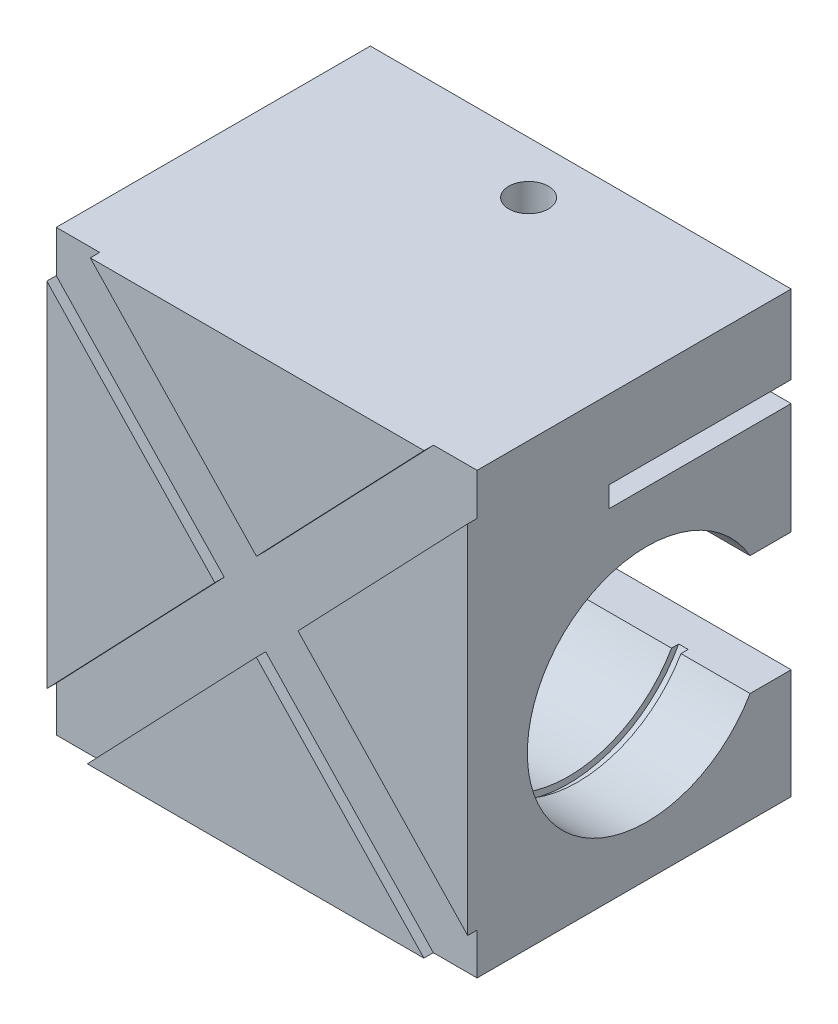
ISO-10303-21;
HEADER;
FILE_DESCRIPTION(('STEP AP214'),'2;1');
FILE_NAME('part.step','',(''),(''),'','','');
FILE_SCHEMA(('AUTOMOTIVE_DESIGN { 1 0 10303 214 1 1 1 1 }'));
ENDSEC;
DATA;
#1=APPLICATION_CONTEXT('core data for automotive mechanical design processes');
#2=APPLICATION_PROTOCOL_DEFINITION('international standard','automotive_design',2000,#1);
#3=PRODUCT_CONTEXT('',#1,'mechanical');
#4=PRODUCT('Part','Part','',(#3));
#5=PRODUCT_RELATED_PRODUCT_CATEGORY('part','',(#4));
#6=PRODUCT_DEFINITION_FORMATION('','',#4);
#7=PRODUCT_DEFINITION_CONTEXT('part definition',#1,'design');
#8=PRODUCT_DEFINITION('design','',#6,#7);
#9=PRODUCT_DEFINITION_SHAPE('','',#8);
#10=(LENGTH_UNIT() NAMED_UNIT(*) SI_UNIT(.MILLI.,.METRE.));
#11=(NAMED_UNIT(*) PLANE_ANGLE_UNIT() SI_UNIT($,.RADIAN.));
#12=(NAMED_UNIT(*) SI_UNIT($,.STERADIAN.) SOLID_ANGLE_UNIT());
#13=UNCERTAINTY_MEASURE_WITH_UNIT(LENGTH_MEASURE(1.E-05),#10,'distance_accuracy_value','');
#14=(GEOMETRIC_REPRESENTATION_CONTEXT(3) GLOBAL_UNCERTAINTY_ASSIGNED_CONTEXT((#13)) GLOBAL_UNIT_ASSIGNED_CONTEXT((#10,
#11,#12)) REPRESENTATION_CONTEXT('',''));
#15=CARTESIAN_POINT('',(0.,0.,0.));
#16=DIRECTION('',(0.,0.,1.));
#17=DIRECTION('',(1.,0.,0.));
#18=AXIS2_PLACEMENT_3D('',#15,#16,#17);
#19=CARTESIAN_POINT('',(-67.,0.,50.));
#20=DIRECTION('',(0.,0.,1.));
#21=DIRECTION('',(1.,0.,0.));
#22=AXIS2_PLACEMENT_3D('',#19,#20,#21);
#23=PLANE('',#22);
#24=DIRECTION('',(-0.687892349406312,0.725812727656566,0.));
#25=VECTOR('',#24,1.);
#26=CARTESIAN_POINT('',(3.29703367803096,3.12477882576566,50.));
#27=LINE('',#26,#25);
#28=CARTESIAN_POINT('',(0.,6.60356298304335,50.));
#29=VERTEX_POINT('',#28);
#30=CARTESIAN_POINT('',(-27.009894200004,35.1023898706218,50.));
#31=VERTEX_POINT('',#30);
#32=EDGE_CURVE('E126',#29,#31,#27,.T.);
#33=ORIENTED_EDGE('',*,*,#32,.T.);
#34=DIRECTION('',(-0.690869316587817,-0.722979659048222,0.));
#35=VECTOR('',#34,1.);
#36=CARTESIAN_POINT('',(-31.651158906905,30.2454076675031,50.));
#37=LINE('',#36,#35);
#38=CARTESIAN_POINT('',(0.,63.367654560757,50.));
#39=VERTEX_POINT('',#38);
#40=EDGE_CURVE('E339',#39,#31,#37,.T.);
#41=ORIENTED_EDGE('',*,*,#40,.F.);
#42=DIRECTION('',(0.,-1.,0.));
#43=VECTOR('',#42,1.);
#44=CARTESIAN_POINT('',(0.,0.,50.));
#45=LINE('',#44,#43);
#46=CARTESIAN_POINT('',(0.,70.,50.));
#47=VERTEX_POINT('',#46);
#48=EDGE_CURVE('E496',#47,#39,#45,.T.);
#49=ORIENTED_EDGE('',*,*,#48,.F.);
#50=DIRECTION('',(1.,0.,0.));
#51=VECTOR('',#50,1.);
#52=CARTESIAN_POINT('',(-67.,70.,50.));
#53=LINE('',#52,#51);
#54=CARTESIAN_POINT('',(-6.94060472686293,70.,50.));
#55=VERTEX_POINT('',#54);
#56=EDGE_CURVE('E519',#55,#47,#53,.T.);
#57=ORIENTED_EDGE('',*,*,#56,.F.);
#58=DIRECTION('',(0.690869316587817,0.722979659048222,0.));
#59=VECTOR('',#58,1.);
#60=CARTESIAN_POINT('',(-38.5917636337679,36.8777531067461,50.));
#61=LINE('',#60,#59);
#62=CARTESIAN_POINT('',(-33.6217674440668,42.0787456308429,50.));
#63=VERTEX_POINT('',#62);
#64=EDGE_CURVE('E375',#63,#55,#61,.T.);
#65=ORIENTED_EDGE('',*,*,#64,.F.);
#66=DIRECTION('',(-0.687892349406312,0.725812727656566,0.));
#67=VECTOR('',#66,1.);
#68=CARTESIAN_POINT('',(3.29703367803097,3.12477882576567,50.));
#69=LINE('',#68,#67);
#70=CARTESIAN_POINT('',(-60.08426463447,70.,50.));
#71=VERTEX_POINT('',#70);
#72=EDGE_CURVE('E370',#63,#71,#69,.T.);
#73=ORIENTED_EDGE('',*,*,#72,.T.);
#74=CARTESIAN_POINT('',(-67.,70.,50.));
#75=VERTEX_POINT('',#74);
#76=EDGE_CURVE('E516',#75,#71,#53,.T.);
#77=ORIENTED_EDGE('',*,*,#76,.F.);
#78=DIRECTION('',(0.,-1.,0.));
#79=VECTOR('',#78,1.);
#80=CARTESIAN_POINT('',(-67.,0.,50.));
#81=LINE('',#80,#79);
#82=CARTESIAN_POINT('',(-67.,63.341726623669,50.));
#83=VERTEX_POINT('',#82);
#84=EDGE_CURVE('E468',#75,#83,#81,.T.);
#85=ORIENTED_EDGE('',*,*,#84,.T.);
#86=DIRECTION('',(0.687892349406312,-0.725812727656566,0.));
#87=VECTOR('',#86,1.);
#88=CARTESIAN_POINT('',(-3.6705537142568,-3.4787841572777,50.));
#89=LINE('',#88,#87);
#90=CARTESIAN_POINT('',(-40.2620499528762,35.1298349339345,50.));
#91=VERTEX_POINT('',#90);
#92=EDGE_CURVE('E389',#83,#91,#89,.T.);
#93=ORIENTED_EDGE('',*,*,#92,.T.);
#94=DIRECTION('',(0.690869316587817,0.722979659048222,0.));
#95=VECTOR('',#94,1.);
#96=CARTESIAN_POINT('',(-38.5917636337679,36.8777531067461,50.));
#97=LINE('',#96,#95);
#98=CARTESIAN_POINT('',(-67.,7.1491538636082,50.));
#99=VERTEX_POINT('',#98);
#100=EDGE_CURVE('E394',#99,#91,#97,.T.);
#101=ORIENTED_EDGE('',*,*,#100,.F.);
#102=CARTESIAN_POINT('',(-67.,0.,50.));
#103=VERTEX_POINT('',#102);
#104=EDGE_CURVE('E467',#99,#103,#81,.T.);
#105=ORIENTED_EDGE('',*,*,#104,.T.);
#106=DIRECTION('',(1.,0.,0.));
#107=VECTOR('',#106,1.);
#108=CARTESIAN_POINT('',(-67.,0.,50.));
#109=LINE('',#108,#107);
#110=CARTESIAN_POINT('',(-60.553250222553,0.,50.));
#111=VERTEX_POINT('',#110);
#112=EDGE_CURVE('E513',#103,#111,#109,.T.);
#113=ORIENTED_EDGE('',*,*,#112,.T.);
#114=DIRECTION('',(-0.690869316587817,-0.722979659048222,0.));
#115=VECTOR('',#114,1.);
#116=CARTESIAN_POINT('',(-31.651158906905,30.2454076675031,50.));
#117=LINE('',#116,#115);
#118=CARTESIAN_POINT('',(-33.6501767088134,28.1534791737134,50.));
#119=VERTEX_POINT('',#118);
#120=EDGE_CURVE('E134',#119,#111,#117,.T.);
#121=ORIENTED_EDGE('',*,*,#120,.F.);
#122=DIRECTION('',(0.687892349406312,-0.725812727656566,0.));
#123=VECTOR('',#122,1.);
#124=CARTESIAN_POINT('',(-3.67055371425679,-3.47878415727769,50.));
#125=LINE('',#124,#123);
#126=CARTESIAN_POINT('',(-6.96758739228776,0.,50.));
#127=VERTEX_POINT('',#126);
#128=EDGE_CURVE('E325',#119,#127,#125,.T.);
#129=ORIENTED_EDGE('',*,*,#128,.T.);
#130=CARTESIAN_POINT('',(0.,0.,50.));
#131=VERTEX_POINT('',#130);
#132=EDGE_CURVE('E515',#127,#131,#109,.T.);
#133=ORIENTED_EDGE('',*,*,#132,.T.);
#134=EDGE_CURVE('E495',#29,#131,#45,.T.);
#135=ORIENTED_EDGE('',*,*,#134,.F.);
#136=EDGE_LOOP('',(#33,#41,#49,#57,#65,#73,#77,#85,#93,#101,#105,#113,#121,#129,#133,#135));
#137=FACE_BOUND('',#136,.T.);
#138=ADVANCED_FACE('F111',(#137),#23,.T.);
#139=CARTESIAN_POINT('',(-67.,27.,23.));
#140=DIRECTION('',(1.,0.,0.));
#141=DIRECTION('',(0.,0.,-1.));
#142=AXIS2_PLACEMENT_3D('',#139,#140,#141);
#143=CYLINDRICAL_SURFACE('',#142,19.);
#144=CARTESIAN_POINT('',(-54.5,27.,23.));
#145=DIRECTION('',(-1.,0.,0.));
#146=DIRECTION('',(0.,0.,1.));
#147=AXIS2_PLACEMENT_3D('',#144,#145,#146);
#148=CIRCLE('',#147,19.);
#149=CARTESIAN_POINT('',(-54.5,36.5,6.54551732809567));
#150=VERTEX_POINT('',#149);
#151=CARTESIAN_POINT('',(-54.5,17.5,6.54551732809567));
#152=VERTEX_POINT('',#151);
#153=EDGE_CURVE('E414',#150,#152,#148,.F.);
#154=ORIENTED_EDGE('',*,*,#153,.F.);
#155=DIRECTION('',(1.,0.,0.));
#156=VECTOR('',#155,1.);
#157=CARTESIAN_POINT('',(-67.,36.5,6.54551732809567));
#158=LINE('',#157,#156);
#159=CARTESIAN_POINT('',(-12.5,36.5,6.54551732809567));
#160=VERTEX_POINT('',#159);
#161=EDGE_CURVE('E540',#150,#160,#158,.T.);
#162=ORIENTED_EDGE('',*,*,#161,.T.);
#163=CARTESIAN_POINT('',(-12.5,27.,23.));
#164=DIRECTION('',(1.,0.,0.));
#165=DIRECTION('',(0.,0.,-1.));
#166=AXIS2_PLACEMENT_3D('',#163,#164,#165);
#167=CIRCLE('',#166,19.);
#168=CARTESIAN_POINT('',(-12.5,17.5,6.54551732809567));
#169=VERTEX_POINT('',#168);
#170=EDGE_CURVE('E432',#169,#160,#167,.F.);
#171=ORIENTED_EDGE('',*,*,#170,.F.);
#172=DIRECTION('',(1.,0.,0.));
#173=VECTOR('',#172,1.);
#174=CARTESIAN_POINT('',(-67.,17.5,6.54551732809567));
#175=LINE('',#174,#173);
#176=EDGE_CURVE('E507',#152,#169,#175,.T.);
#177=ORIENTED_EDGE('',*,*,#176,.F.);
#178=EDGE_LOOP('',(#154,#162,#171,#177));
#179=FACE_BOUND('',#178,.T.);
#180=ADVANCED_FACE('F565',(#179),#143,.F.);
#181=CARTESIAN_POINT('',(-67.,36.5,6.54551732809567));
#182=VERTEX_POINT('',#181);
#183=CARTESIAN_POINT('',(-56.,36.5,6.54551732809567));
#184=VERTEX_POINT('',#183);
#185=EDGE_CURVE('E537',#182,#184,#158,.T.);
#186=ORIENTED_EDGE('',*,*,#185,.T.);
#187=CARTESIAN_POINT('',(-56.,27.,23.));
#188=DIRECTION('',(-1.,0.,0.));
#189=DIRECTION('',(0.,0.,1.));
#190=AXIS2_PLACEMENT_3D('',#187,#188,#189);
#191=CIRCLE('',#190,19.);
#192=CARTESIAN_POINT('',(-56.,17.5,6.54551732809567));
#193=VERTEX_POINT('',#192);
#194=EDGE_CURVE('E421',#184,#193,#191,.F.);
#195=ORIENTED_EDGE('',*,*,#194,.T.);
#196=CARTESIAN_POINT('',(-67.,17.5,6.54551732809567));
#197=VERTEX_POINT('',#196);
#198=EDGE_CURVE('E503',#197,#193,#175,.T.);
#199=ORIENTED_EDGE('',*,*,#198,.F.);
#200=CARTESIAN_POINT('',(-67.,27.,23.));
#201=DIRECTION('',(1.,0.,0.));
#202=DIRECTION('',(0.,0.,-1.));
#203=AXIS2_PLACEMENT_3D('',#200,#201,#202);
#204=CIRCLE('',#203,19.);
#205=EDGE_CURVE('E449',#182,#197,#204,.T.);
#206=ORIENTED_EDGE('',*,*,#205,.F.);
#207=EDGE_LOOP('',(#186,#195,#199,#206));
#208=FACE_BOUND('',#207,.T.);
#209=ADVANCED_FACE('F647',(#208),#143,.F.);
#210=CARTESIAN_POINT('',(-11.,17.5,6.54551732809567));
#211=VERTEX_POINT('',#210);
#212=CARTESIAN_POINT('',(0.,17.5,6.54551732809567));
#213=VERTEX_POINT('',#212);
#214=EDGE_CURVE('E508',#211,#213,#175,.T.);
#215=ORIENTED_EDGE('',*,*,#214,.F.);
#216=CARTESIAN_POINT('',(-11.,27.,23.));
#217=DIRECTION('',(1.,0.,0.));
#218=DIRECTION('',(0.,0.,-1.));
#219=AXIS2_PLACEMENT_3D('',#216,#217,#218);
#220=CIRCLE('',#219,19.);
#221=CARTESIAN_POINT('',(-11.,36.5,6.54551732809567));
#222=VERTEX_POINT('',#221);
#223=EDGE_CURVE('E440',#211,#222,#220,.F.);
#224=ORIENTED_EDGE('',*,*,#223,.T.);
#225=CARTESIAN_POINT('',(0.,36.5,6.54551732809567));
#226=VERTEX_POINT('',#225);
#227=EDGE_CURVE('E476',#222,#226,#158,.T.);
#228=ORIENTED_EDGE('',*,*,#227,.T.);
#229=CARTESIAN_POINT('',(0.,27.,23.));
#230=DIRECTION('',(1.,0.,0.));
#231=DIRECTION('',(0.,0.,-1.));
#232=AXIS2_PLACEMENT_3D('',#229,#230,#231);
#233=CIRCLE('',#232,19.);
#234=EDGE_CURVE('E448',#226,#213,#233,.T.);
#235=ORIENTED_EDGE('',*,*,#234,.T.);
#236=EDGE_LOOP('',(#215,#224,#228,#235));
#237=FACE_BOUND('',#236,.T.);
#238=ADVANCED_FACE('F113',(#237),#143,.F.);
#239=CARTESIAN_POINT('',(-67.,17.5,0.));
#240=DIRECTION('',(0.,1.,0.));
#241=DIRECTION('',(0.,0.,1.));
#242=AXIS2_PLACEMENT_3D('',#239,#240,#241);
#243=PLANE('',#242);
#244=DIRECTION('',(0.,0.,1.));
#245=VECTOR('',#244,1.);
#246=CARTESIAN_POINT('',(-56.,17.5,0.));
#247=LINE('',#246,#245);
#248=CARTESIAN_POINT('',(-56.,17.5,5.40028409320196));
#249=VERTEX_POINT('',#248);
#250=EDGE_CURVE('E424',#249,#193,#247,.T.);
#251=ORIENTED_EDGE('',*,*,#250,.F.);
#252=DIRECTION('',(1.,0.,0.));
#253=VECTOR('',#252,1.);
#254=CARTESIAN_POINT('',(-56.,17.5,5.40028409320196));
#255=LINE('',#254,#253);
#256=CARTESIAN_POINT('',(-54.5,17.5,5.40028409320196));
#257=VERTEX_POINT('',#256);
#258=EDGE_CURVE('E426',#257,#249,#255,.F.);
#259=ORIENTED_EDGE('',*,*,#258,.F.);
#260=DIRECTION('',(0.,0.,1.));
#261=VECTOR('',#260,1.);
#262=CARTESIAN_POINT('',(-54.5,17.5,0.));
#263=LINE('',#262,#261);
#264=EDGE_CURVE('E418',#257,#152,#263,.T.);
#265=ORIENTED_EDGE('',*,*,#264,.T.);
#266=ORIENTED_EDGE('',*,*,#176,.T.);
#267=DIRECTION('',(0.,0.,-1.));
#268=VECTOR('',#267,1.);
#269=CARTESIAN_POINT('',(-12.5,17.5,0.));
#270=LINE('',#269,#268);
#271=CARTESIAN_POINT('',(-12.5,17.5,5.40028409320196));
#272=VERTEX_POINT('',#271);
#273=EDGE_CURVE('E437',#169,#272,#270,.T.);
#274=ORIENTED_EDGE('',*,*,#273,.T.);
#275=DIRECTION('',(-1.,0.,0.));
#276=VECTOR('',#275,1.);
#277=CARTESIAN_POINT('',(-11.,17.5,5.40028409320196));
#278=LINE('',#277,#276);
#279=CARTESIAN_POINT('',(-11.,17.5,5.40028409320196));
#280=VERTEX_POINT('',#279);
#281=EDGE_CURVE('E445',#272,#280,#278,.F.);
#282=ORIENTED_EDGE('',*,*,#281,.T.);
#283=DIRECTION('',(0.,0.,-1.));
#284=VECTOR('',#283,1.);
#285=CARTESIAN_POINT('',(-11.,17.5,0.));
#286=LINE('',#285,#284);
#287=EDGE_CURVE('E443',#211,#280,#286,.T.);
#288=ORIENTED_EDGE('',*,*,#287,.F.);
#289=ORIENTED_EDGE('',*,*,#214,.T.);
#290=DIRECTION('',(0.,0.,1.));
#291=VECTOR('',#290,1.);
#292=CARTESIAN_POINT('',(0.,17.5,0.));
#293=LINE('',#292,#291);
#294=CARTESIAN_POINT('',(0.,17.5,0.));
#295=VERTEX_POINT('',#294);
#296=EDGE_CURVE('E452',#295,#213,#293,.T.);
#297=ORIENTED_EDGE('',*,*,#296,.F.);
#298=DIRECTION('',(1.,0.,0.));
#299=VECTOR('',#298,1.);
#300=CARTESIAN_POINT('',(-67.,17.5,0.));
#301=LINE('',#300,#299);
#302=CARTESIAN_POINT('',(-67.,17.5,0.));
#303=VERTEX_POINT('',#302);
#304=EDGE_CURVE('E509',#303,#295,#301,.T.);
#305=ORIENTED_EDGE('',*,*,#304,.F.);
#306=DIRECTION('',(0.,0.,1.));
#307=VECTOR('',#306,1.);
#308=CARTESIAN_POINT('',(-67.,17.5,0.));
#309=LINE('',#308,#307);
#310=EDGE_CURVE('E473',#303,#197,#309,.T.);
#311=ORIENTED_EDGE('',*,*,#310,.T.);
#312=ORIENTED_EDGE('',*,*,#198,.T.);
#313=EDGE_LOOP('',(#251,#259,#265,#266,#274,#282,#288,#289,#297,#305,#311,#312));
#314=FACE_BOUND('',#313,.T.);
#315=ADVANCED_FACE('F573',(#314),#243,.T.);
#316=CARTESIAN_POINT('',(-67.,0.,0.));
#317=DIRECTION('',(0.,0.,1.));
#318=DIRECTION('',(0.,-1.,0.));
#319=AXIS2_PLACEMENT_3D('',#316,#317,#318);
#320=PLANE('',#319);
#321=DIRECTION('',(0.,-1.,0.));
#322=VECTOR('',#321,1.);
#323=CARTESIAN_POINT('',(0.,0.,0.));
#324=LINE('',#323,#322);
#325=CARTESIAN_POINT('',(0.,0.,0.));
#326=VERTEX_POINT('',#325);
#327=EDGE_CURVE('E486',#295,#326,#324,.T.);
#328=ORIENTED_EDGE('',*,*,#327,.T.);
#329=DIRECTION('',(1.,0.,0.));
#330=VECTOR('',#329,1.);
#331=CARTESIAN_POINT('',(-67.,0.,0.));
#332=LINE('',#331,#330);
#333=CARTESIAN_POINT('',(-67.,0.,0.));
#334=VERTEX_POINT('',#333);
#335=EDGE_CURVE('E511',#334,#326,#332,.T.);
#336=ORIENTED_EDGE('',*,*,#335,.F.);
#337=DIRECTION('',(0.,-1.,0.));
#338=VECTOR('',#337,1.);
#339=CARTESIAN_POINT('',(-67.,0.,0.));
#340=LINE('',#339,#338);
#341=EDGE_CURVE('E458',#303,#334,#340,.T.);
#342=ORIENTED_EDGE('',*,*,#341,.F.);
#343=ORIENTED_EDGE('',*,*,#304,.T.);
#344=EDGE_LOOP('',(#328,#336,#342,#343));
#345=FACE_BOUND('',#344,.T.);
#346=ADVANCED_FACE('F616',(#345),#320,.F.);
#347=CARTESIAN_POINT('',(-67.,0.,0.));
#348=DIRECTION('',(0.,-1.,0.));
#349=DIRECTION('',(0.,0.,-1.));
#350=AXIS2_PLACEMENT_3D('',#347,#348,#349);
#351=PLANE('',#350);
#352=DIRECTION('',(0.,0.,-1.));
#353=VECTOR('',#352,1.);
#354=CARTESIAN_POINT('',(0.,0.,0.));
#355=LINE('',#354,#353);
#356=EDGE_CURVE('E498',#131,#326,#355,.T.);
#357=ORIENTED_EDGE('',*,*,#356,.F.);
#358=ORIENTED_EDGE('',*,*,#132,.F.);
#359=DIRECTION('',(0.,0.,-1.));
#360=VECTOR('',#359,1.);
#361=CARTESIAN_POINT('',(-6.96758739228776,0.,51.5));
#362=LINE('',#361,#360);
#363=CARTESIAN_POINT('',(-6.96758739228776,0.,51.5));
#364=VERTEX_POINT('',#363);
#365=EDGE_CURVE('E360',#364,#127,#362,.T.);
#366=ORIENTED_EDGE('',*,*,#365,.F.);
#367=DIRECTION('',(1.,0.,0.));
#368=VECTOR('',#367,1.);
#369=CARTESIAN_POINT('',(0.,0.,51.5));
#370=LINE('',#369,#368);
#371=CARTESIAN_POINT('',(-60.553250222553,0.,51.5));
#372=VERTEX_POINT('',#371);
#373=EDGE_CURVE('E358',#372,#364,#370,.T.);
#374=ORIENTED_EDGE('',*,*,#373,.F.);
#375=DIRECTION('',(0.,0.,-1.));
#376=VECTOR('',#375,1.);
#377=CARTESIAN_POINT('',(-60.553250222553,0.,51.5));
#378=LINE('',#377,#376);
#379=EDGE_CURVE('E365',#372,#111,#378,.T.);
#380=ORIENTED_EDGE('',*,*,#379,.T.);
#381=ORIENTED_EDGE('',*,*,#112,.F.);
#382=DIRECTION('',(0.,0.,-1.));
#383=VECTOR('',#382,1.);
#384=CARTESIAN_POINT('',(-67.,0.,0.));
#385=LINE('',#384,#383);
#386=EDGE_CURVE('E470',#103,#334,#385,.T.);
#387=ORIENTED_EDGE('',*,*,#386,.T.);
#388=ORIENTED_EDGE('',*,*,#335,.T.);
#389=EDGE_LOOP('',(#357,#358,#366,#374,#380,#381,#387,#388));
#390=FACE_BOUND('',#389,.T.);
#391=ADVANCED_FACE('F619',(#390),#351,.T.);
#392=CARTESIAN_POINT('',(-67.,70.,0.));
#393=DIRECTION('',(0.,-1.,0.));
#394=DIRECTION('',(0.,0.,-1.));
#395=AXIS2_PLACEMENT_3D('',#392,#393,#394);
#396=PLANE('',#395);
#397=CARTESIAN_POINT('',(-33.5,70.,8.3));
#398=DIRECTION('',(0.,1.,0.));
#399=DIRECTION('',(0.,0.,1.));
#400=AXIS2_PLACEMENT_3D('',#397,#398,#399);
#401=CIRCLE('',#400,3.15);
#402=CARTESIAN_POINT('',(-33.5,70.,11.45));
#403=VERTEX_POINT('',#402);
#404=EDGE_CURVE('E344',#403,#403,#401,.T.);
#405=ORIENTED_EDGE('',*,*,#404,.F.);
#406=EDGE_LOOP('',(#405));
#407=FACE_BOUND('',#406,.T.);
#408=DIRECTION('',(0.,0.,-1.));
#409=VECTOR('',#408,1.);
#410=CARTESIAN_POINT('',(0.,70.,0.));
#411=LINE('',#410,#409);
#412=CARTESIAN_POINT('',(0.,70.,0.));
#413=VERTEX_POINT('',#412);
#414=EDGE_CURVE('E493',#47,#413,#411,.T.);
#415=ORIENTED_EDGE('',*,*,#414,.T.);
#416=DIRECTION('',(1.,0.,0.));
#417=VECTOR('',#416,1.);
#418=CARTESIAN_POINT('',(-67.,70.,0.));
#419=LINE('',#418,#417);
#420=CARTESIAN_POINT('',(-67.,70.,0.));
#421=VERTEX_POINT('',#420);
#422=EDGE_CURVE('E520',#421,#413,#419,.T.);
#423=ORIENTED_EDGE('',*,*,#422,.F.);
#424=DIRECTION('',(0.,0.,-1.));
#425=VECTOR('',#424,1.);
#426=CARTESIAN_POINT('',(-67.,70.,0.));
#427=LINE('',#426,#425);
#428=EDGE_CURVE('E465',#75,#421,#427,.T.);
#429=ORIENTED_EDGE('',*,*,#428,.F.);
#430=ORIENTED_EDGE('',*,*,#76,.T.);
#431=DIRECTION('',(0.,0.,-1.));
#432=VECTOR('',#431,1.);
#433=CARTESIAN_POINT('',(-60.08426463447,70.,51.5));
#434=LINE('',#433,#432);
#435=CARTESIAN_POINT('',(-60.08426463447,70.,51.5));
#436=VERTEX_POINT('',#435);
#437=EDGE_CURVE('E379',#436,#71,#434,.T.);
#438=ORIENTED_EDGE('',*,*,#437,.F.);
#439=DIRECTION('',(-1.,0.,0.));
#440=VECTOR('',#439,1.);
#441=CARTESIAN_POINT('',(0.,70.,51.5));
#442=LINE('',#441,#440);
#443=CARTESIAN_POINT('',(-6.94060472686293,70.,51.5));
#444=VERTEX_POINT('',#443);
#445=EDGE_CURVE('E377',#444,#436,#442,.T.);
#446=ORIENTED_EDGE('',*,*,#445,.F.);
#447=DIRECTION('',(0.,0.,-1.));
#448=VECTOR('',#447,1.);
#449=CARTESIAN_POINT('',(-6.94060472686293,70.,51.5));
#450=LINE('',#449,#448);
#451=EDGE_CURVE('E385',#444,#55,#450,.T.);
#452=ORIENTED_EDGE('',*,*,#451,.T.);
#453=ORIENTED_EDGE('',*,*,#56,.T.);
#454=EDGE_LOOP('',(#415,#423,#429,#430,#438,#446,#452,#453));
#455=FACE_BOUND('',#454,.T.);
#456=ADVANCED_FACE('F651',(#407,#455),#396,.F.);
#457=CARTESIAN_POINT('',(0.,57.5,0.));
#458=VERTEX_POINT('',#457);
#459=EDGE_CURVE('E487',#413,#458,#324,.T.);
#460=ORIENTED_EDGE('',*,*,#459,.T.);
#461=DIRECTION('',(1.,0.,0.));
#462=VECTOR('',#461,1.);
#463=CARTESIAN_POINT('',(-67.,57.5,0.));
#464=LINE('',#463,#462);
#465=CARTESIAN_POINT('',(-67.,57.5,0.));
#466=VERTEX_POINT('',#465);
#467=EDGE_CURVE('E523',#466,#458,#464,.T.);
#468=ORIENTED_EDGE('',*,*,#467,.F.);
#469=EDGE_CURVE('E459',#421,#466,#340,.T.);
#470=ORIENTED_EDGE('',*,*,#469,.F.);
#471=ORIENTED_EDGE('',*,*,#422,.T.);
#472=EDGE_LOOP('',(#460,#468,#470,#471));
#473=FACE_BOUND('',#472,.T.);
#474=ADVANCED_FACE('F585',(#473),#320,.F.);
#475=CARTESIAN_POINT('',(-67.,57.5,0.));
#476=DIRECTION('',(0.,1.,0.));
#477=DIRECTION('',(0.,0.,1.));
#478=AXIS2_PLACEMENT_3D('',#475,#476,#477);
#479=PLANE('',#478);
#480=CARTESIAN_POINT('',(-33.5,57.5,8.3));
#481=DIRECTION('',(0.,1.,0.));
#482=DIRECTION('',(0.,0.,1.));
#483=AXIS2_PLACEMENT_3D('',#480,#481,#482);
#484=CIRCLE('',#483,3.15);
#485=CARTESIAN_POINT('',(-33.5,57.5,11.45));
#486=VERTEX_POINT('',#485);
#487=EDGE_CURVE('E349',#486,#486,#484,.T.);
#488=ORIENTED_EDGE('',*,*,#487,.T.);
#489=EDGE_LOOP('',(#488));
#490=FACE_BOUND('',#489,.T.);
#491=DIRECTION('',(0.,0.,1.));
#492=VECTOR('',#491,1.);
#493=CARTESIAN_POINT('',(0.,57.5,0.));
#494=LINE('',#493,#492);
#495=CARTESIAN_POINT('',(0.,57.5,29.));
#496=VERTEX_POINT('',#495);
#497=EDGE_CURVE('E491',#458,#496,#494,.T.);
#498=ORIENTED_EDGE('',*,*,#497,.T.);
#499=DIRECTION('',(1.,0.,0.));
#500=VECTOR('',#499,1.);
#501=CARTESIAN_POINT('',(-67.,57.5,29.));
#502=LINE('',#501,#500);
#503=CARTESIAN_POINT('',(-67.,57.5,29.));
#504=VERTEX_POINT('',#503);
#505=EDGE_CURVE('E526',#504,#496,#502,.T.);
#506=ORIENTED_EDGE('',*,*,#505,.F.);
#507=DIRECTION('',(0.,0.,1.));
#508=VECTOR('',#507,1.);
#509=CARTESIAN_POINT('',(-67.,57.5,0.));
#510=LINE('',#509,#508);
#511=EDGE_CURVE('E463',#466,#504,#510,.T.);
#512=ORIENTED_EDGE('',*,*,#511,.F.);
#513=ORIENTED_EDGE('',*,*,#467,.T.);
#514=EDGE_LOOP('',(#498,#506,#512,#513));
#515=FACE_BOUND('',#514,.T.);
#516=ADVANCED_FACE('F592',(#490,#515),#479,.F.);
#517=CARTESIAN_POINT('',(-67.,0.,29.));
#518=DIRECTION('',(0.,0.,1.));
#519=DIRECTION('',(1.,0.,0.));
#520=AXIS2_PLACEMENT_3D('',#517,#518,#519);
#521=PLANE('',#520);
#522=DIRECTION('',(0.,-1.,0.));
#523=VECTOR('',#522,1.);
#524=CARTESIAN_POINT('',(0.,0.,29.));
#525=LINE('',#524,#523);
#526=CARTESIAN_POINT('',(0.,54.2,29.));
#527=VERTEX_POINT('',#526);
#528=EDGE_CURVE('E489',#496,#527,#525,.T.);
#529=ORIENTED_EDGE('',*,*,#528,.T.);
#530=DIRECTION('',(1.,0.,0.));
#531=VECTOR('',#530,1.);
#532=CARTESIAN_POINT('',(-67.,54.2,29.));
#533=LINE('',#532,#531);
#534=CARTESIAN_POINT('',(-67.,54.2,29.));
#535=VERTEX_POINT('',#534);
#536=EDGE_CURVE('E529',#535,#527,#533,.T.);
#537=ORIENTED_EDGE('',*,*,#536,.F.);
#538=DIRECTION('',(0.,-1.,0.));
#539=VECTOR('',#538,1.);
#540=CARTESIAN_POINT('',(-67.,0.,29.));
#541=LINE('',#540,#539);
#542=EDGE_CURVE('E461',#504,#535,#541,.T.);
#543=ORIENTED_EDGE('',*,*,#542,.F.);
#544=ORIENTED_EDGE('',*,*,#505,.T.);
#545=EDGE_LOOP('',(#529,#537,#543,#544));
#546=FACE_BOUND('',#545,.T.);
#547=ADVANCED_FACE('F599',(#546),#521,.F.);
#548=CARTESIAN_POINT('',(-67.,54.2,0.));
#549=DIRECTION('',(0.,-1.,0.));
#550=DIRECTION('',(0.,0.,-1.));
#551=AXIS2_PLACEMENT_3D('',#548,#549,#550);
#552=PLANE('',#551);
#553=DIRECTION('',(0.,0.,-1.));
#554=VECTOR('',#553,1.);
#555=CARTESIAN_POINT('',(0.,54.2,0.));
#556=LINE('',#555,#554);
#557=CARTESIAN_POINT('',(0.,54.2,0.));
#558=VERTEX_POINT('',#557);
#559=EDGE_CURVE('E485',#527,#558,#556,.T.);
#560=ORIENTED_EDGE('',*,*,#559,.T.);
#561=DIRECTION('',(1.,0.,0.));
#562=VECTOR('',#561,1.);
#563=CARTESIAN_POINT('',(-67.,54.2,0.));
#564=LINE('',#563,#562);
#565=CARTESIAN_POINT('',(-67.,54.2,0.));
#566=VERTEX_POINT('',#565);
#567=EDGE_CURVE('E532',#566,#558,#564,.T.);
#568=ORIENTED_EDGE('',*,*,#567,.F.);
#569=DIRECTION('',(0.,0.,-1.));
#570=VECTOR('',#569,1.);
#571=CARTESIAN_POINT('',(-67.,54.2,0.));
#572=LINE('',#571,#570);
#573=EDGE_CURVE('E457',#535,#566,#572,.T.);
#574=ORIENTED_EDGE('',*,*,#573,.F.);
#575=ORIENTED_EDGE('',*,*,#536,.T.);
#576=EDGE_LOOP('',(#560,#568,#574,#575));
#577=FACE_BOUND('',#576,.T.);
#578=ADVANCED_FACE('F603',(#577),#552,.F.);
#579=CARTESIAN_POINT('',(0.,36.5,0.));
#580=VERTEX_POINT('',#579);
#581=EDGE_CURVE('E482',#558,#580,#324,.T.);
#582=ORIENTED_EDGE('',*,*,#581,.T.);
#583=DIRECTION('',(1.,0.,0.));
#584=VECTOR('',#583,1.);
#585=CARTESIAN_POINT('',(-67.,36.5,0.));
#586=LINE('',#585,#584);
#587=CARTESIAN_POINT('',(-67.,36.5,0.));
#588=VERTEX_POINT('',#587);
#589=EDGE_CURVE('E535',#588,#580,#586,.T.);
#590=ORIENTED_EDGE('',*,*,#589,.F.);
#591=EDGE_CURVE('E455',#566,#588,#340,.T.);
#592=ORIENTED_EDGE('',*,*,#591,.F.);
#593=ORIENTED_EDGE('',*,*,#567,.T.);
#594=EDGE_LOOP('',(#582,#590,#592,#593));
#595=FACE_BOUND('',#594,.T.);
#596=ADVANCED_FACE('F661',(#595),#320,.F.);
#597=CARTESIAN_POINT('',(-67.,36.5,0.));
#598=DIRECTION('',(0.,-1.,0.));
#599=DIRECTION('',(0.,0.,-1.));
#600=AXIS2_PLACEMENT_3D('',#597,#598,#599);
#601=PLANE('',#600);
#602=DIRECTION('',(0.,0.,-1.));
#603=VECTOR('',#602,1.);
#604=CARTESIAN_POINT('',(-56.,36.5,0.));
#605=LINE('',#604,#603);
#606=CARTESIAN_POINT('',(-56.,36.5,5.40028409320196));
#607=VERTEX_POINT('',#606);
#608=EDGE_CURVE('E12',#184,#607,#605,.T.);
#609=ORIENTED_EDGE('',*,*,#608,.F.);
#610=ORIENTED_EDGE('',*,*,#185,.F.);
#611=DIRECTION('',(0.,0.,-1.));
#612=VECTOR('',#611,1.);
#613=CARTESIAN_POINT('',(-67.,36.5,0.));
#614=LINE('',#613,#612);
#615=EDGE_CURVE('E451',#182,#588,#614,.T.);
#616=ORIENTED_EDGE('',*,*,#615,.T.);
#617=ORIENTED_EDGE('',*,*,#589,.T.);
#618=DIRECTION('',(0.,0.,-1.));
#619=VECTOR('',#618,1.);
#620=CARTESIAN_POINT('',(0.,36.5,0.));
#621=LINE('',#620,#619);
#622=EDGE_CURVE('E479',#226,#580,#621,.T.);
#623=ORIENTED_EDGE('',*,*,#622,.F.);
#624=ORIENTED_EDGE('',*,*,#227,.F.);
#625=DIRECTION('',(0.,0.,1.));
#626=VECTOR('',#625,1.);
#627=CARTESIAN_POINT('',(-11.,36.5,0.));
#628=LINE('',#627,#626);
#629=CARTESIAN_POINT('',(-11.,36.5,5.40028409320196));
#630=VERTEX_POINT('',#629);
#631=EDGE_CURVE('E546',#630,#222,#628,.T.);
#632=ORIENTED_EDGE('',*,*,#631,.F.);
#633=DIRECTION('',(-1.,0.,0.));
#634=VECTOR('',#633,1.);
#635=CARTESIAN_POINT('',(-11.,36.5,5.40028409320196));
#636=LINE('',#635,#634);
#637=CARTESIAN_POINT('',(-12.5,36.5,5.40028409320196));
#638=VERTEX_POINT('',#637);
#639=EDGE_CURVE('E543',#630,#638,#636,.T.);
#640=ORIENTED_EDGE('',*,*,#639,.T.);
#641=DIRECTION('',(0.,0.,1.));
#642=VECTOR('',#641,1.);
#643=CARTESIAN_POINT('',(-12.5,36.5,0.));
#644=LINE('',#643,#642);
#645=EDGE_CURVE('E506',#638,#160,#644,.T.);
#646=ORIENTED_EDGE('',*,*,#645,.T.);
#647=ORIENTED_EDGE('',*,*,#161,.F.);
#648=DIRECTION('',(0.,0.,-1.));
#649=VECTOR('',#648,1.);
#650=CARTESIAN_POINT('',(-54.5,36.5,0.));
#651=LINE('',#650,#649);
#652=CARTESIAN_POINT('',(-54.5,36.5,5.40028409320196));
#653=VERTEX_POINT('',#652);
#654=EDGE_CURVE('E548',#150,#653,#651,.T.);
#655=ORIENTED_EDGE('',*,*,#654,.T.);
#656=DIRECTION('',(1.,0.,0.));
#657=VECTOR('',#656,1.);
#658=CARTESIAN_POINT('',(-56.,36.5,5.40028409320196));
#659=LINE('',#658,#657);
#660=EDGE_CURVE('E119',#607,#653,#659,.T.);
#661=ORIENTED_EDGE('',*,*,#660,.F.);
#662=EDGE_LOOP('',(#609,#610,#616,#617,#623,#624,#632,#640,#646,#647,#655,#661));
#663=FACE_BOUND('',#662,.T.);
#664=ADVANCED_FACE('F559',(#663),#601,.T.);
#665=CARTESIAN_POINT('',(-67.,0.,0.));
#666=DIRECTION('',(1.,0.,0.));
#667=DIRECTION('',(0.,0.,-1.));
#668=AXIS2_PLACEMENT_3D('',#665,#666,#667);
#669=PLANE('',#668);
#670=ORIENTED_EDGE('',*,*,#205,.T.);
#671=ORIENTED_EDGE('',*,*,#310,.F.);
#672=ORIENTED_EDGE('',*,*,#341,.T.);
#673=ORIENTED_EDGE('',*,*,#386,.F.);
#674=ORIENTED_EDGE('',*,*,#104,.F.);
#675=DIRECTION('',(0.,0.,-1.));
#676=VECTOR('',#675,1.);
#677=CARTESIAN_POINT('',(-67.,7.1491538636082,51.5));
#678=LINE('',#677,#676);
#679=CARTESIAN_POINT('',(-67.,7.1491538636082,51.5));
#680=VERTEX_POINT('',#679);
#681=EDGE_CURVE('E404',#680,#99,#678,.T.);
#682=ORIENTED_EDGE('',*,*,#681,.F.);
#683=DIRECTION('',(0.,-1.,0.));
#684=VECTOR('',#683,1.);
#685=CARTESIAN_POINT('',(-67.,0.,51.5));
#686=LINE('',#685,#684);
#687=CARTESIAN_POINT('',(-67.,63.341726623669,51.5));
#688=VERTEX_POINT('',#687);
#689=EDGE_CURVE('E393',#688,#680,#686,.T.);
#690=ORIENTED_EDGE('',*,*,#689,.F.);
#691=DIRECTION('',(0.,0.,-1.));
#692=VECTOR('',#691,1.);
#693=CARTESIAN_POINT('',(-67.,63.341726623669,51.5));
#694=LINE('',#693,#692);
#695=EDGE_CURVE('E407',#688,#83,#694,.T.);
#696=ORIENTED_EDGE('',*,*,#695,.T.);
#697=ORIENTED_EDGE('',*,*,#84,.F.);
#698=ORIENTED_EDGE('',*,*,#428,.T.);
#699=ORIENTED_EDGE('',*,*,#469,.T.);
#700=ORIENTED_EDGE('',*,*,#511,.T.);
#701=ORIENTED_EDGE('',*,*,#542,.T.);
#702=ORIENTED_EDGE('',*,*,#573,.T.);
#703=ORIENTED_EDGE('',*,*,#591,.T.);
#704=ORIENTED_EDGE('',*,*,#615,.F.);
#705=EDGE_LOOP('',(#670,#671,#672,#673,#674,#682,#690,#696,#697,#698,#699,#700,#701,#702,#703,#704));
#706=FACE_BOUND('',#705,.T.);
#707=ADVANCED_FACE('F607',(#706),#669,.F.);
#708=CARTESIAN_POINT('',(0.,0.,0.));
#709=DIRECTION('',(1.,0.,0.));
#710=DIRECTION('',(0.,0.,-1.));
#711=AXIS2_PLACEMENT_3D('',#708,#709,#710);
#712=PLANE('',#711);
#713=ORIENTED_EDGE('',*,*,#234,.F.);
#714=ORIENTED_EDGE('',*,*,#622,.T.);
#715=ORIENTED_EDGE('',*,*,#581,.F.);
#716=ORIENTED_EDGE('',*,*,#559,.F.);
#717=ORIENTED_EDGE('',*,*,#528,.F.);
#718=ORIENTED_EDGE('',*,*,#497,.F.);
#719=ORIENTED_EDGE('',*,*,#459,.F.);
#720=ORIENTED_EDGE('',*,*,#414,.F.);
#721=ORIENTED_EDGE('',*,*,#48,.T.);
#722=DIRECTION('',(0.,0.,-1.));
#723=VECTOR('',#722,1.);
#724=CARTESIAN_POINT('',(0.,63.367654560757,51.5));
#725=LINE('',#724,#723);
#726=CARTESIAN_POINT('',(0.,63.367654560757,51.5));
#727=VERTEX_POINT('',#726);
#728=EDGE_CURVE('E326',#727,#39,#725,.T.);
#729=ORIENTED_EDGE('',*,*,#728,.F.);
#730=DIRECTION('',(0.,1.,0.));
#731=VECTOR('',#730,1.);
#732=CARTESIAN_POINT('',(0.,0.,51.5));
#733=LINE('',#732,#731);
#734=CARTESIAN_POINT('',(0.,6.60356298304335,51.5));
#735=VERTEX_POINT('',#734);
#736=EDGE_CURVE('E329',#735,#727,#733,.T.);
#737=ORIENTED_EDGE('',*,*,#736,.F.);
#738=DIRECTION('',(0.,0.,-1.));
#739=VECTOR('',#738,1.);
#740=CARTESIAN_POINT('',(0.,6.60356298304335,51.5));
#741=LINE('',#740,#739);
#742=EDGE_CURVE('E318',#735,#29,#741,.T.);
#743=ORIENTED_EDGE('',*,*,#742,.T.);
#744=ORIENTED_EDGE('',*,*,#134,.T.);
#745=ORIENTED_EDGE('',*,*,#356,.T.);
#746=ORIENTED_EDGE('',*,*,#327,.F.);
#747=ORIENTED_EDGE('',*,*,#296,.T.);
#748=EDGE_LOOP('',(#713,#714,#715,#716,#717,#718,#719,#720,#721,#729,#737,#743,#744,#745,#746,#747));
#749=FACE_BOUND('',#748,.T.);
#750=ADVANCED_FACE('F331',(#749),#712,.T.);
#751=CARTESIAN_POINT('',(-11.,27.,23.));
#752=DIRECTION('',(-1.,0.,0.));
#753=DIRECTION('',(0.,0.,1.));
#754=AXIS2_PLACEMENT_3D('',#751,#752,#753);
#755=CYLINDRICAL_SURFACE('',#754,20.);
#756=CARTESIAN_POINT('',(-12.5,27.,23.));
#757=DIRECTION('',(1.,0.,0.));
#758=DIRECTION('',(0.,0.,-1.));
#759=AXIS2_PLACEMENT_3D('',#756,#757,#758);
#760=CIRCLE('',#759,20.);
#761=EDGE_CURVE('E428',#638,#272,#760,.T.);
#762=ORIENTED_EDGE('',*,*,#761,.F.);
#763=ORIENTED_EDGE('',*,*,#639,.F.);
#764=CARTESIAN_POINT('',(-11.,27.,23.));
#765=DIRECTION('',(1.,0.,0.));
#766=DIRECTION('',(0.,0.,-1.));
#767=AXIS2_PLACEMENT_3D('',#764,#765,#766);
#768=CIRCLE('',#767,20.);
#769=EDGE_CURVE('E429',#630,#280,#768,.T.);
#770=ORIENTED_EDGE('',*,*,#769,.T.);
#771=ORIENTED_EDGE('',*,*,#281,.F.);
#772=EDGE_LOOP('',(#762,#763,#770,#771));
#773=FACE_BOUND('',#772,.T.);
#774=ADVANCED_FACE('F683',(#773),#755,.F.);
#775=CARTESIAN_POINT('',(-11.,27.,23.));
#776=DIRECTION('',(1.,0.,0.));
#777=DIRECTION('',(0.,0.,-1.));
#778=AXIS2_PLACEMENT_3D('',#775,#776,#777);
#779=PLANE('',#778);
#780=ORIENTED_EDGE('',*,*,#287,.T.);
#781=ORIENTED_EDGE('',*,*,#769,.F.);
#782=ORIENTED_EDGE('',*,*,#631,.T.);
#783=ORIENTED_EDGE('',*,*,#223,.F.);
#784=EDGE_LOOP('',(#780,#781,#782,#783));
#785=FACE_BOUND('',#784,.T.);
#786=ADVANCED_FACE('F687',(#785),#779,.F.);
#787=CARTESIAN_POINT('',(-12.5,27.,23.));
#788=DIRECTION('',(1.,0.,0.));
#789=DIRECTION('',(0.,0.,-1.));
#790=AXIS2_PLACEMENT_3D('',#787,#788,#789);
#791=PLANE('',#790);
#792=ORIENTED_EDGE('',*,*,#170,.T.);
#793=ORIENTED_EDGE('',*,*,#645,.F.);
#794=ORIENTED_EDGE('',*,*,#761,.T.);
#795=ORIENTED_EDGE('',*,*,#273,.F.);
#796=EDGE_LOOP('',(#792,#793,#794,#795));
#797=FACE_BOUND('',#796,.T.);
#798=ADVANCED_FACE('F689',(#797),#791,.T.);
#799=CARTESIAN_POINT('',(-56.,27.,23.));
#800=DIRECTION('',(1.,0.,0.));
#801=DIRECTION('',(0.,0.,-1.));
#802=AXIS2_PLACEMENT_3D('',#799,#800,#801);
#803=CYLINDRICAL_SURFACE('',#802,20.);
#804=ORIENTED_EDGE('',*,*,#258,.T.);
#805=CARTESIAN_POINT('',(-56.,27.,23.));
#806=DIRECTION('',(1.,0.,0.));
#807=DIRECTION('',(0.,0.,-1.));
#808=AXIS2_PLACEMENT_3D('',#805,#806,#807);
#809=CIRCLE('',#808,20.);
#810=EDGE_CURVE('E411',#607,#249,#809,.T.);
#811=ORIENTED_EDGE('',*,*,#810,.F.);
#812=ORIENTED_EDGE('',*,*,#660,.T.);
#813=CARTESIAN_POINT('',(-54.5,27.,23.));
#814=DIRECTION('',(1.,0.,0.));
#815=DIRECTION('',(0.,0.,-1.));
#816=AXIS2_PLACEMENT_3D('',#813,#814,#815);
#817=CIRCLE('',#816,20.);
#818=EDGE_CURVE('E410',#653,#257,#817,.T.);
#819=ORIENTED_EDGE('',*,*,#818,.T.);
#820=EDGE_LOOP('',(#804,#811,#812,#819));
#821=FACE_BOUND('',#820,.T.);
#822=ADVANCED_FACE('F554',(#821),#803,.F.);
#823=CARTESIAN_POINT('',(-56.,27.,23.));
#824=DIRECTION('',(-1.,0.,0.));
#825=DIRECTION('',(0.,0.,-1.));
#826=AXIS2_PLACEMENT_3D('',#823,#824,#825);
#827=PLANE('',#826);
#828=ORIENTED_EDGE('',*,*,#250,.T.);
#829=ORIENTED_EDGE('',*,*,#194,.F.);
#830=ORIENTED_EDGE('',*,*,#608,.T.);
#831=ORIENTED_EDGE('',*,*,#810,.T.);
#832=EDGE_LOOP('',(#828,#829,#830,#831));
#833=FACE_BOUND('',#832,.T.);
#834=ADVANCED_FACE('F698',(#833),#827,.F.);
#835=CARTESIAN_POINT('',(-54.5,27.,23.));
#836=DIRECTION('',(-1.,0.,0.));
#837=DIRECTION('',(0.,0.,-1.));
#838=AXIS2_PLACEMENT_3D('',#835,#836,#837);
#839=PLANE('',#838);
#840=ORIENTED_EDGE('',*,*,#818,.F.);
#841=ORIENTED_EDGE('',*,*,#654,.F.);
#842=ORIENTED_EDGE('',*,*,#153,.T.);
#843=ORIENTED_EDGE('',*,*,#264,.F.);
#844=EDGE_LOOP('',(#840,#841,#842,#843));
#845=FACE_BOUND('',#844,.T.);
#846=ADVANCED_FACE('F562',(#845),#839,.T.);
#847=CARTESIAN_POINT('',(-3.6705537142568,-3.4787841572777,51.5));
#848=DIRECTION('',(0.725812727656566,0.687892349406312,0.));
#849=DIRECTION('',(-0.687892349406312,0.725812727656566,0.));
#850=AXIS2_PLACEMENT_3D('',#847,#848,#849);
#851=PLANE('',#850);
#852=ORIENTED_EDGE('',*,*,#92,.F.);
#853=ORIENTED_EDGE('',*,*,#695,.F.);
#854=DIRECTION('',(0.687892349406312,-0.725812727656566,0.));
#855=VECTOR('',#854,1.);
#856=CARTESIAN_POINT('',(-3.6705537142568,-3.4787841572777,51.5));
#857=LINE('',#856,#855);
#858=CARTESIAN_POINT('',(-40.2620499528762,35.1298349339345,51.5));
#859=VERTEX_POINT('',#858);
#860=EDGE_CURVE('E390',#688,#859,#857,.T.);
#861=ORIENTED_EDGE('',*,*,#860,.T.);
#862=DIRECTION('',(0.,0.,-1.));
#863=VECTOR('',#862,1.);
#864=CARTESIAN_POINT('',(-40.2620499528762,35.1298349339345,51.5));
#865=LINE('',#864,#863);
#866=EDGE_CURVE('E398',#859,#91,#865,.T.);
#867=ORIENTED_EDGE('',*,*,#866,.T.);
#868=EDGE_LOOP('',(#852,#853,#861,#867));
#869=FACE_BOUND('',#868,.T.);
#870=ADVANCED_FACE('F701',(#869),#851,.T.);
#871=CARTESIAN_POINT('',(-38.5917636337679,36.8777531067461,51.5));
#872=DIRECTION('',(-0.722979659048221,0.690869316587817,0.));
#873=DIRECTION('',(-0.690869316587817,-0.722979659048221,0.));
#874=AXIS2_PLACEMENT_3D('',#871,#872,#873);
#875=PLANE('',#874);
#876=ORIENTED_EDGE('',*,*,#100,.T.);
#877=ORIENTED_EDGE('',*,*,#866,.F.);
#878=DIRECTION('',(0.690869316587817,0.722979659048222,0.));
#879=VECTOR('',#878,1.);
#880=CARTESIAN_POINT('',(-38.5917636337679,36.8777531067461,51.5));
#881=LINE('',#880,#879);
#882=EDGE_CURVE('E396',#680,#859,#881,.T.);
#883=ORIENTED_EDGE('',*,*,#882,.F.);
#884=ORIENTED_EDGE('',*,*,#681,.T.);
#885=EDGE_LOOP('',(#876,#877,#883,#884));
#886=FACE_BOUND('',#885,.T.);
#887=ADVANCED_FACE('F707',(#886),#875,.F.);
#888=CARTESIAN_POINT('',(0.,0.,51.5));
#889=DIRECTION('',(0.,0.,1.));
#890=DIRECTION('',(1.,0.,0.));
#891=AXIS2_PLACEMENT_3D('',#888,#889,#890);
#892=PLANE('',#891);
#893=ORIENTED_EDGE('',*,*,#860,.F.);
#894=ORIENTED_EDGE('',*,*,#689,.T.);
#895=ORIENTED_EDGE('',*,*,#882,.T.);
#896=EDGE_LOOP('',(#893,#894,#895));
#897=FACE_BOUND('',#896,.T.);
#898=ADVANCED_FACE('F711',(#897),#892,.T.);
#899=CARTESIAN_POINT('',(3.29703367803097,3.12477882576567,51.5));
#900=DIRECTION('',(-0.725812727656566,-0.687892349406312,0.));
#901=DIRECTION('',(0.687892349406312,-0.725812727656566,0.));
#902=AXIS2_PLACEMENT_3D('',#899,#900,#901);
#903=PLANE('',#902);
#904=ORIENTED_EDGE('',*,*,#72,.F.);
#905=DIRECTION('',(0.,0.,-1.));
#906=VECTOR('',#905,1.);
#907=CARTESIAN_POINT('',(-33.6217674440668,42.0787456308429,51.5));
#908=LINE('',#907,#906);
#909=CARTESIAN_POINT('',(-33.6217674440668,42.0787456308429,51.5));
#910=VERTEX_POINT('',#909);
#911=EDGE_CURVE('E387',#910,#63,#908,.T.);
#912=ORIENTED_EDGE('',*,*,#911,.F.);
#913=DIRECTION('',(-0.687892349406312,0.725812727656566,0.));
#914=VECTOR('',#913,1.);
#915=CARTESIAN_POINT('',(3.29703367803097,3.12477882576567,51.5));
#916=LINE('',#915,#914);
#917=EDGE_CURVE('E371',#910,#436,#916,.T.);
#918=ORIENTED_EDGE('',*,*,#917,.T.);
#919=ORIENTED_EDGE('',*,*,#437,.T.);
#920=EDGE_LOOP('',(#904,#912,#918,#919));
#921=FACE_BOUND('',#920,.T.);
#922=ADVANCED_FACE('F715',(#921),#903,.T.);
#923=CARTESIAN_POINT('',(-38.5917636337679,36.8777531067461,51.5));
#924=DIRECTION('',(-0.722979659048222,0.690869316587817,0.));
#925=DIRECTION('',(-0.690869316587817,-0.722979659048222,0.));
#926=AXIS2_PLACEMENT_3D('',#923,#924,#925);
#927=PLANE('',#926);
#928=ORIENTED_EDGE('',*,*,#64,.T.);
#929=ORIENTED_EDGE('',*,*,#451,.F.);
#930=DIRECTION('',(0.690869316587817,0.722979659048222,0.));
#931=VECTOR('',#930,1.);
#932=CARTESIAN_POINT('',(-38.5917636337679,36.8777531067461,51.5));
#933=LINE('',#932,#931);
#934=EDGE_CURVE('E374',#910,#444,#933,.T.);
#935=ORIENTED_EDGE('',*,*,#934,.F.);
#936=ORIENTED_EDGE('',*,*,#911,.T.);
#937=EDGE_LOOP('',(#928,#929,#935,#936));
#938=FACE_BOUND('',#937,.T.);
#939=ADVANCED_FACE('F719',(#938),#927,.F.);
#940=CARTESIAN_POINT('',(0.,0.,51.5));
#941=DIRECTION('',(0.,0.,1.));
#942=DIRECTION('',(1.,0.,0.));
#943=AXIS2_PLACEMENT_3D('',#940,#941,#942);
#944=PLANE('',#943);
#945=ORIENTED_EDGE('',*,*,#917,.F.);
#946=ORIENTED_EDGE('',*,*,#934,.T.);
#947=ORIENTED_EDGE('',*,*,#445,.T.);
#948=EDGE_LOOP('',(#945,#946,#947));
#949=FACE_BOUND('',#948,.T.);
#950=ADVANCED_FACE('F723',(#949),#944,.T.);
#951=CARTESIAN_POINT('',(-3.67055371425679,-3.47878415727769,51.5));
#952=DIRECTION('',(0.725812727656566,0.687892349406312,0.));
#953=DIRECTION('',(-0.687892349406312,0.725812727656566,0.));
#954=AXIS2_PLACEMENT_3D('',#951,#952,#953);
#955=PLANE('',#954);
#956=ORIENTED_EDGE('',*,*,#128,.F.);
#957=DIRECTION('',(0.,0.,-1.));
#958=VECTOR('',#957,1.);
#959=CARTESIAN_POINT('',(-33.6501767088134,28.1534791737134,51.5));
#960=LINE('',#959,#958);
#961=CARTESIAN_POINT('',(-33.6501767088134,28.1534791737134,51.5));
#962=VERTEX_POINT('',#961);
#963=EDGE_CURVE('E368',#962,#119,#960,.T.);
#964=ORIENTED_EDGE('',*,*,#963,.F.);
#965=DIRECTION('',(0.687892349406312,-0.725812727656566,0.));
#966=VECTOR('',#965,1.);
#967=CARTESIAN_POINT('',(-3.67055371425679,-3.47878415727769,51.5));
#968=LINE('',#967,#966);
#969=EDGE_CURVE('E353',#962,#364,#968,.T.);
#970=ORIENTED_EDGE('',*,*,#969,.T.);
#971=ORIENTED_EDGE('',*,*,#365,.T.);
#972=EDGE_LOOP('',(#956,#964,#970,#971));
#973=FACE_BOUND('',#972,.T.);
#974=ADVANCED_FACE('F628',(#973),#955,.T.);
#975=CARTESIAN_POINT('',(-31.651158906905,30.2454076675031,51.5));
#976=DIRECTION('',(0.722979659048222,-0.690869316587817,0.));
#977=DIRECTION('',(0.690869316587817,0.722979659048222,0.));
#978=AXIS2_PLACEMENT_3D('',#975,#976,#977);
#979=PLANE('',#978);
#980=ORIENTED_EDGE('',*,*,#120,.T.);
#981=ORIENTED_EDGE('',*,*,#379,.F.);
#982=DIRECTION('',(-0.690869316587817,-0.722979659048222,0.));
#983=VECTOR('',#982,1.);
#984=CARTESIAN_POINT('',(-31.651158906905,30.2454076675031,51.5));
#985=LINE('',#984,#983);
#986=EDGE_CURVE('E356',#962,#372,#985,.T.);
#987=ORIENTED_EDGE('',*,*,#986,.F.);
#988=ORIENTED_EDGE('',*,*,#963,.T.);
#989=EDGE_LOOP('',(#980,#981,#987,#988));
#990=FACE_BOUND('',#989,.T.);
#991=ADVANCED_FACE('F623',(#990),#979,.F.);
#992=CARTESIAN_POINT('',(0.,0.,51.5));
#993=DIRECTION('',(0.,0.,1.));
#994=DIRECTION('',(1.,0.,0.));
#995=AXIS2_PLACEMENT_3D('',#992,#993,#994);
#996=PLANE('',#995);
#997=ORIENTED_EDGE('',*,*,#969,.F.);
#998=ORIENTED_EDGE('',*,*,#986,.T.);
#999=ORIENTED_EDGE('',*,*,#373,.T.);
#1000=EDGE_LOOP('',(#997,#998,#999));
#1001=FACE_BOUND('',#1000,.T.);
#1002=ADVANCED_FACE('F632',(#1001),#996,.T.);
#1003=CARTESIAN_POINT('',(3.29703367803096,3.12477882576566,51.5));
#1004=DIRECTION('',(-0.725812727656566,-0.687892349406312,0.));
#1005=DIRECTION('',(0.687892349406312,-0.725812727656566,0.));
#1006=AXIS2_PLACEMENT_3D('',#1003,#1004,#1005);
#1007=PLANE('',#1006);
#1008=ORIENTED_EDGE('',*,*,#32,.F.);
#1009=ORIENTED_EDGE('',*,*,#742,.F.);
#1010=DIRECTION('',(-0.687892349406312,0.725812727656566,0.));
#1011=VECTOR('',#1010,1.);
#1012=CARTESIAN_POINT('',(3.29703367803096,3.12477882576566,51.5));
#1013=LINE('',#1012,#1011);
#1014=CARTESIAN_POINT('',(-27.009894200004,35.1023898706218,51.5));
#1015=VERTEX_POINT('',#1014);
#1016=EDGE_CURVE('E322',#735,#1015,#1013,.T.);
#1017=ORIENTED_EDGE('',*,*,#1016,.T.);
#1018=DIRECTION('',(0.,0.,-1.));
#1019=VECTOR('',#1018,1.);
#1020=CARTESIAN_POINT('',(-27.009894200004,35.1023898706218,51.5));
#1021=LINE('',#1020,#1019);
#1022=EDGE_CURVE('E348',#1015,#31,#1021,.T.);
#1023=ORIENTED_EDGE('',*,*,#1022,.T.);
#1024=EDGE_LOOP('',(#1008,#1009,#1017,#1023));
#1025=FACE_BOUND('',#1024,.T.);
#1026=ADVANCED_FACE('F320',(#1025),#1007,.T.);
#1027=CARTESIAN_POINT('',(-31.651158906905,30.2454076675031,51.5));
#1028=DIRECTION('',(0.722979659048222,-0.690869316587817,0.));
#1029=DIRECTION('',(0.690869316587817,0.722979659048222,0.));
#1030=AXIS2_PLACEMENT_3D('',#1027,#1028,#1029);
#1031=PLANE('',#1030);
#1032=ORIENTED_EDGE('',*,*,#40,.T.);
#1033=ORIENTED_EDGE('',*,*,#1022,.F.);
#1034=DIRECTION('',(-0.690869316587817,-0.722979659048222,0.));
#1035=VECTOR('',#1034,1.);
#1036=CARTESIAN_POINT('',(-31.651158906905,30.2454076675031,51.5));
#1037=LINE('',#1036,#1035);
#1038=EDGE_CURVE('E335',#727,#1015,#1037,.T.);
#1039=ORIENTED_EDGE('',*,*,#1038,.F.);
#1040=ORIENTED_EDGE('',*,*,#728,.T.);
#1041=EDGE_LOOP('',(#1032,#1033,#1039,#1040));
#1042=FACE_BOUND('',#1041,.T.);
#1043=ADVANCED_FACE('F639',(#1042),#1031,.F.);
#1044=CARTESIAN_POINT('',(0.,0.,51.5));
#1045=DIRECTION('',(0.,0.,1.));
#1046=DIRECTION('',(1.,0.,0.));
#1047=AXIS2_PLACEMENT_3D('',#1044,#1045,#1046);
#1048=PLANE('',#1047);
#1049=ORIENTED_EDGE('',*,*,#1016,.F.);
#1050=ORIENTED_EDGE('',*,*,#736,.T.);
#1051=ORIENTED_EDGE('',*,*,#1038,.T.);
#1052=EDGE_LOOP('',(#1049,#1050,#1051));
#1053=FACE_BOUND('',#1052,.T.);
#1054=ADVANCED_FACE('F337',(#1053),#1048,.T.);
#1055=CARTESIAN_POINT('',(-33.5,57.5,8.3));
#1056=DIRECTION('',(0.,1.,0.));
#1057=DIRECTION('',(0.,0.,1.));
#1058=AXIS2_PLACEMENT_3D('',#1055,#1056,#1057);
#1059=CYLINDRICAL_SURFACE('',#1058,3.15);
#1060=ORIENTED_EDGE('',*,*,#487,.F.);
#1061=EDGE_LOOP('',(#1060));
#1062=FACE_BOUND('',#1061,.T.);
#1063=ORIENTED_EDGE('',*,*,#404,.T.);
#1064=EDGE_LOOP('',(#1063));
#1065=FACE_BOUND('',#1064,.T.);
#1066=ADVANCED_FACE('F765',(#1062,#1065),#1059,.F.);
#1067=CLOSED_SHELL('',(#138,#180,#209,#238,#315,#346,#391,#456,#474,#516,#547,#578,#596,#664,
#707,#750,#774,#786,#798,#822,#834,#846,#870,#887,#898,#922,#939,#950,#974,#991,#1002,#1026,
#1043,#1054,#1066));
#1068=MANIFOLD_SOLID_BREP('B2',#1067);
#1069=ADVANCED_BREP_SHAPE_REPRESENTATION('',(#18,#1068),#14);
#1070=SHAPE_DEFINITION_REPRESENTATION(#9,#1069);
ENDSEC;
END-ISO-10303-21;
